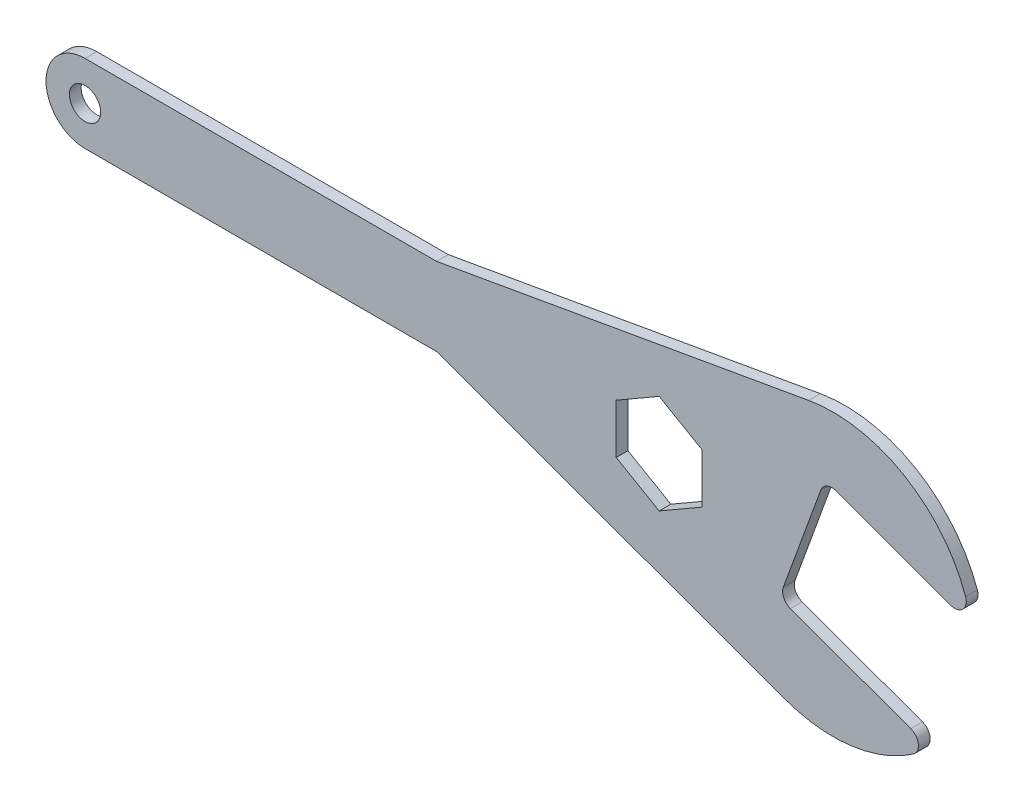
ISO-10303-21;
HEADER;
FILE_DESCRIPTION(('STEP AP214'),'2;1');
FILE_NAME('part.step','',(''),(''),'','','');
FILE_SCHEMA(('AUTOMOTIVE_DESIGN { 1 0 10303 214 1 1 1 1 }'));
ENDSEC;
DATA;
#1=APPLICATION_CONTEXT('core data for automotive mechanical design processes');
#2=APPLICATION_PROTOCOL_DEFINITION('international standard','automotive_design',2000,#1);
#3=PRODUCT_CONTEXT('',#1,'mechanical');
#4=PRODUCT('Part','Part','',(#3));
#5=PRODUCT_RELATED_PRODUCT_CATEGORY('part','',(#4));
#6=PRODUCT_DEFINITION_FORMATION('','',#4);
#7=PRODUCT_DEFINITION_CONTEXT('part definition',#1,'design');
#8=PRODUCT_DEFINITION('design','',#6,#7);
#9=PRODUCT_DEFINITION_SHAPE('','',#8);
#10=(LENGTH_UNIT() NAMED_UNIT(*) SI_UNIT(.MILLI.,.METRE.));
#11=(NAMED_UNIT(*) PLANE_ANGLE_UNIT() SI_UNIT($,.RADIAN.));
#12=(NAMED_UNIT(*) SI_UNIT($,.STERADIAN.) SOLID_ANGLE_UNIT());
#13=UNCERTAINTY_MEASURE_WITH_UNIT(LENGTH_MEASURE(1.E-05),#10,'distance_accuracy_value','');
#14=(GEOMETRIC_REPRESENTATION_CONTEXT(3) GLOBAL_UNCERTAINTY_ASSIGNED_CONTEXT((#13)) GLOBAL_UNIT_ASSIGNED_CONTEXT((#10,
#11,#12)) REPRESENTATION_CONTEXT('',''));
#15=CARTESIAN_POINT('',(0.,0.,0.));
#16=DIRECTION('',(0.,0.,1.));
#17=DIRECTION('',(1.,0.,0.));
#18=AXIS2_PLACEMENT_3D('',#15,#16,#17);
#19=CARTESIAN_POINT('',(0.,0.,3.));
#20=DIRECTION('',(0.,0.,-1.));
#21=DIRECTION('',(-1.,0.,0.));
#22=AXIS2_PLACEMENT_3D('',#19,#20,#21);
#23=CYLINDRICAL_SURFACE('',#22,10.);
#24=CARTESIAN_POINT('',(0.,0.,0.));
#25=DIRECTION('',(0.,0.,1.));
#26=DIRECTION('',(1.,0.,0.));
#27=AXIS2_PLACEMENT_3D('',#24,#25,#26);
#28=CIRCLE('',#27,10.);
#29=CARTESIAN_POINT('',(0.,10.,0.));
#30=VERTEX_POINT('',#29);
#31=CARTESIAN_POINT('',(0.,-10.,0.));
#32=VERTEX_POINT('',#31);
#33=EDGE_CURVE('E258',#30,#32,#28,.T.);
#34=ORIENTED_EDGE('',*,*,#33,.T.);
#35=DIRECTION('',(0.,0.,-1.));
#36=VECTOR('',#35,1.);
#37=CARTESIAN_POINT('',(0.,-10.,3.));
#38=LINE('',#37,#36);
#39=CARTESIAN_POINT('',(0.,-10.,3.));
#40=VERTEX_POINT('',#39);
#41=EDGE_CURVE('E295',#40,#32,#38,.T.);
#42=ORIENTED_EDGE('',*,*,#41,.F.);
#43=CARTESIAN_POINT('',(0.,0.,3.));
#44=DIRECTION('',(0.,0.,1.));
#45=DIRECTION('',(1.,0.,0.));
#46=AXIS2_PLACEMENT_3D('',#43,#44,#45);
#47=CIRCLE('',#46,10.);
#48=CARTESIAN_POINT('',(0.,10.,3.));
#49=VERTEX_POINT('',#48);
#50=EDGE_CURVE('E233',#49,#40,#47,.T.);
#51=ORIENTED_EDGE('',*,*,#50,.F.);
#52=DIRECTION('',(0.,0.,-1.));
#53=VECTOR('',#52,1.);
#54=CARTESIAN_POINT('',(0.,10.,3.));
#55=LINE('',#54,#53);
#56=EDGE_CURVE('E257',#49,#30,#55,.T.);
#57=ORIENTED_EDGE('',*,*,#56,.T.);
#58=EDGE_LOOP('',(#34,#42,#51,#57));
#59=FACE_BOUND('',#58,.T.);
#60=ADVANCED_FACE('F35',(#59),#23,.T.);
#61=CARTESIAN_POINT('',(0.,-10.,3.));
#62=DIRECTION('',(0.,1.,0.));
#63=DIRECTION('',(-1.,0.,0.));
#64=AXIS2_PLACEMENT_3D('',#61,#62,#63);
#65=PLANE('',#64);
#66=DIRECTION('',(1.,0.,0.));
#67=VECTOR('',#66,1.);
#68=CARTESIAN_POINT('',(0.,-10.,0.));
#69=LINE('',#68,#67);
#70=CARTESIAN_POINT('',(89.9804958595262,-10.,0.));
#71=VERTEX_POINT('',#70);
#72=EDGE_CURVE('E261',#32,#71,#69,.T.);
#73=ORIENTED_EDGE('',*,*,#72,.T.);
#74=DIRECTION('',(0.,0.,-1.));
#75=VECTOR('',#74,1.);
#76=CARTESIAN_POINT('',(89.9804958595262,-10.,3.));
#77=LINE('',#76,#75);
#78=CARTESIAN_POINT('',(89.9804958595262,-10.,3.));
#79=VERTEX_POINT('',#78);
#80=EDGE_CURVE('E292',#79,#71,#77,.T.);
#81=ORIENTED_EDGE('',*,*,#80,.F.);
#82=DIRECTION('',(1.,0.,0.));
#83=VECTOR('',#82,1.);
#84=CARTESIAN_POINT('',(0.,-10.,3.));
#85=LINE('',#84,#83);
#86=EDGE_CURVE('E236',#40,#79,#85,.T.);
#87=ORIENTED_EDGE('',*,*,#86,.F.);
#88=ORIENTED_EDGE('',*,*,#41,.T.);
#89=EDGE_LOOP('',(#73,#81,#87,#88));
#90=FACE_BOUND('',#89,.T.);
#91=ADVANCED_FACE('F363',(#90),#65,.F.);
#92=CARTESIAN_POINT('',(89.9804958595262,-10.,3.));
#93=DIRECTION('',(0.34202014332567,0.939692620785908,0.));
#94=DIRECTION('',(-0.939692620785908,0.34202014332567,0.));
#95=AXIS2_PLACEMENT_3D('',#92,#93,#94);
#96=PLANE('',#95);
#97=DIRECTION('',(0.939692620785908,-0.34202014332567,0.));
#98=VECTOR('',#97,1.);
#99=CARTESIAN_POINT('',(89.9804958595262,-10.,0.));
#100=LINE('',#99,#98);
#101=CARTESIAN_POINT('',(179.22149968912,-42.4810690700083,0.));
#102=VERTEX_POINT('',#101);
#103=EDGE_CURVE('E264',#71,#102,#100,.T.);
#104=ORIENTED_EDGE('',*,*,#103,.T.);
#105=DIRECTION('',(0.,0.,-1.));
#106=VECTOR('',#105,1.);
#107=CARTESIAN_POINT('',(179.22149968912,-42.4810690700083,3.));
#108=LINE('',#107,#106);
#109=CARTESIAN_POINT('',(179.22149968912,-42.4810690700083,3.));
#110=VERTEX_POINT('',#109);
#111=EDGE_CURVE('E289',#110,#102,#108,.T.);
#112=ORIENTED_EDGE('',*,*,#111,.F.);
#113=DIRECTION('',(0.939692620785908,-0.34202014332567,0.));
#114=VECTOR('',#113,1.);
#115=CARTESIAN_POINT('',(89.9804958595262,-10.,3.));
#116=LINE('',#115,#114);
#117=EDGE_CURVE('E239',#79,#110,#116,.T.);
#118=ORIENTED_EDGE('',*,*,#117,.F.);
#119=ORIENTED_EDGE('',*,*,#80,.T.);
#120=EDGE_LOOP('',(#104,#112,#118,#119));
#121=FACE_BOUND('',#120,.T.);
#122=ADVANCED_FACE('F370',(#121),#96,.F.);
#123=CARTESIAN_POINT('',(191.534224848844,-8.65213472171563,3.));
#124=DIRECTION('',(0.,0.,-1.));
#125=DIRECTION('',(-1.,0.,0.));
#126=AXIS2_PLACEMENT_3D('',#123,#124,#125);
#127=CYLINDRICAL_SURFACE('',#126,36.);
#128=CARTESIAN_POINT('',(191.534224848844,-8.65213472171563,0.));
#129=DIRECTION('',(0.,0.,1.));
#130=DIRECTION('',(1.,0.,0.));
#131=AXIS2_PLACEMENT_3D('',#128,#129,#130);
#132=CIRCLE('',#131,36.);
#133=CARTESIAN_POINT('',(212.104308868192,-38.1965359415231,0.));
#134=VERTEX_POINT('',#133);
#135=EDGE_CURVE('E266',#102,#134,#132,.T.);
#136=ORIENTED_EDGE('',*,*,#135,.T.);
#137=DIRECTION('',(0.,0.,-1.));
#138=VECTOR('',#137,1.);
#139=CARTESIAN_POINT('',(212.104308868192,-38.1965359415231,3.));
#140=LINE('',#139,#138);
#141=CARTESIAN_POINT('',(212.104308868192,-38.1965359415231,3.));
#142=VERTEX_POINT('',#141);
#143=EDGE_CURVE('E303',#134,#142,#140,.F.);
#144=ORIENTED_EDGE('',*,*,#143,.T.);
#145=CARTESIAN_POINT('',(191.534224848844,-8.65213472171563,3.));
#146=DIRECTION('',(0.,0.,1.));
#147=DIRECTION('',(1.,0.,0.));
#148=AXIS2_PLACEMENT_3D('',#145,#146,#147);
#149=CIRCLE('',#148,36.);
#150=EDGE_CURVE('E241',#110,#142,#149,.T.);
#151=ORIENTED_EDGE('',*,*,#150,.F.);
#152=ORIENTED_EDGE('',*,*,#111,.T.);
#153=EDGE_LOOP('',(#136,#144,#151,#152));
#154=FACE_BOUND('',#153,.T.);
#155=ADVANCED_FACE('F374',(#154),#127,.T.);
#156=CARTESIAN_POINT('',(177.770914252774,-20.6695436994003,3.));
#157=DIRECTION('',(-0.342020143325669,-0.939692620785908,0.));
#158=DIRECTION('',(0.939692620785908,-0.342020143325669,0.));
#159=AXIS2_PLACEMENT_3D('',#156,#157,#158);
#160=PLANE('',#159);
#161=DIRECTION('',(-0.939692620785908,0.342020143325669,0.));
#162=VECTOR('',#161,1.);
#163=CARTESIAN_POINT('',(177.770914252774,-20.6695436994003,0.));
#164=LINE('',#163,#162);
#165=CARTESIAN_POINT('',(211.41619562989,-32.9154246441814,0.));
#166=VERTEX_POINT('',#165);
#167=CARTESIAN_POINT('',(180.589992115132,-21.6956041293773,0.));
#168=VERTEX_POINT('',#167);
#169=EDGE_CURVE('E269',#166,#168,#164,.T.);
#170=ORIENTED_EDGE('',*,*,#169,.T.);
#171=DIRECTION('',(0.,0.,-1.));
#172=VECTOR('',#171,1.);
#173=CARTESIAN_POINT('',(180.589992115132,-21.6956041293773,3.));
#174=LINE('',#173,#172);
#175=CARTESIAN_POINT('',(180.589992115132,-21.6956041293773,3.));
#176=VERTEX_POINT('',#175);
#177=EDGE_CURVE('E321',#168,#176,#174,.F.);
#178=ORIENTED_EDGE('',*,*,#177,.T.);
#179=DIRECTION('',(-0.939692620785908,0.342020143325669,0.));
#180=VECTOR('',#179,1.);
#181=CARTESIAN_POINT('',(177.770914252774,-20.6695436994003,3.));
#182=LINE('',#181,#180);
#183=CARTESIAN_POINT('',(211.41619562989,-32.9154246441814,3.));
#184=VERTEX_POINT('',#183);
#185=EDGE_CURVE('E244',#184,#176,#182,.T.);
#186=ORIENTED_EDGE('',*,*,#185,.F.);
#187=DIRECTION('',(0.,0.,-1.));
#188=VECTOR('',#187,1.);
#189=CARTESIAN_POINT('',(211.41619562989,-32.9154246441814,3.));
#190=LINE('',#189,#188);
#191=EDGE_CURVE('E298',#184,#166,#190,.T.);
#192=ORIENTED_EDGE('',*,*,#191,.T.);
#193=EDGE_LOOP('',(#170,#178,#186,#192));
#194=FACE_BOUND('',#193,.T.);
#195=ADVANCED_FACE('F382',(#194),#160,.F.);
#196=CARTESIAN_POINT('',(189.399599125847,11.2800054073206,3.));
#197=DIRECTION('',(-0.939692620785908,0.342020143325669,0.));
#198=DIRECTION('',(-0.342020143325669,-0.939692620785908,0.));
#199=AXIS2_PLACEMENT_3D('',#196,#197,#198);
#200=PLANE('',#199);
#201=DIRECTION('',(0.342020143325669,0.939692620785908,0.));
#202=VECTOR('',#201,1.);
#203=CARTESIAN_POINT('',(189.399599125847,11.2800054073206,0.));
#204=LINE('',#203,#202);
#205=CARTESIAN_POINT('',(178.796974682751,-17.8504658370425,0.));
#206=VERTEX_POINT('',#205);
#207=CARTESIAN_POINT('',(188.37353869587,8.4609275449629,0.));
#208=VERTEX_POINT('',#207);
#209=EDGE_CURVE('E272',#206,#208,#204,.T.);
#210=ORIENTED_EDGE('',*,*,#209,.T.);
#211=DIRECTION('',(0.,0.,-1.));
#212=VECTOR('',#211,1.);
#213=CARTESIAN_POINT('',(188.37353869587,8.46092754496291,3.));
#214=LINE('',#213,#212);
#215=CARTESIAN_POINT('',(188.37353869587,8.4609275449629,3.));
#216=VERTEX_POINT('',#215);
#217=EDGE_CURVE('E56',#208,#216,#214,.F.);
#218=ORIENTED_EDGE('',*,*,#217,.T.);
#219=DIRECTION('',(0.342020143325669,0.939692620785908,0.));
#220=VECTOR('',#219,1.);
#221=CARTESIAN_POINT('',(189.399599125847,11.2800054073206,3.));
#222=LINE('',#221,#220);
#223=CARTESIAN_POINT('',(178.796974682751,-17.8504658370425,3.));
#224=VERTEX_POINT('',#223);
#225=EDGE_CURVE('E247',#224,#216,#222,.T.);
#226=ORIENTED_EDGE('',*,*,#225,.F.);
#227=DIRECTION('',(0.,0.,-1.));
#228=VECTOR('',#227,1.);
#229=CARTESIAN_POINT('',(178.796974682751,-17.8504658370425,0.));
#230=LINE('',#229,#228);
#231=EDGE_CURVE('E318',#224,#206,#230,.T.);
#232=ORIENTED_EDGE('',*,*,#231,.T.);
#233=EDGE_LOOP('',(#210,#218,#226,#232));
#234=FACE_BOUND('',#233,.T.);
#235=ADVANCED_FACE('F388',(#234),#200,.F.);
#236=CARTESIAN_POINT('',(226.987303957283,-2.40080032570615,3.));
#237=DIRECTION('',(0.34202014332567,0.939692620785908,0.));
#238=DIRECTION('',(-0.939692620785908,0.34202014332567,0.));
#239=AXIS2_PLACEMENT_3D('',#236,#237,#238);
#240=PLANE('',#239);
#241=DIRECTION('',(0.939692620785908,-0.34202014332567,0.));
#242=VECTOR('',#241,1.);
#243=CARTESIAN_POINT('',(226.987303957283,-2.40080032570615,3.));
#244=LINE('',#243,#242);
#245=CARTESIAN_POINT('',(192.218676988205,10.2539449773436,3.));
#246=VERTEX_POINT('',#245);
#247=CARTESIAN_POINT('',(221.611256306698,-0.444079002896385,3.));
#248=VERTEX_POINT('',#247);
#249=EDGE_CURVE('E249',#246,#248,#244,.T.);
#250=ORIENTED_EDGE('',*,*,#249,.F.);
#251=DIRECTION('',(0.,0.,-1.));
#252=VECTOR('',#251,1.);
#253=CARTESIAN_POINT('',(192.218676988205,10.2539449773436,0.));
#254=LINE('',#253,#252);
#255=CARTESIAN_POINT('',(192.218676988205,10.2539449773436,0.));
#256=VERTEX_POINT('',#255);
#257=EDGE_CURVE('E327',#246,#256,#254,.T.);
#258=ORIENTED_EDGE('',*,*,#257,.T.);
#259=DIRECTION('',(0.939692620785908,-0.34202014332567,0.));
#260=VECTOR('',#259,1.);
#261=CARTESIAN_POINT('',(226.987303957283,-2.40080032570615,0.));
#262=LINE('',#261,#260);
#263=CARTESIAN_POINT('',(221.611256306698,-0.444079002896385,0.));
#264=VERTEX_POINT('',#263);
#265=EDGE_CURVE('E274',#256,#264,#262,.T.);
#266=ORIENTED_EDGE('',*,*,#265,.T.);
#267=DIRECTION('',(0.,0.,-1.));
#268=VECTOR('',#267,1.);
#269=CARTESIAN_POINT('',(221.611256306698,-0.444079002896386,3.));
#270=LINE('',#269,#268);
#271=EDGE_CURVE('E313',#264,#248,#270,.F.);
#272=ORIENTED_EDGE('',*,*,#271,.T.);
#273=EDGE_LOOP('',(#250,#258,#266,#272));
#274=FACE_BOUND('',#273,.T.);
#275=ADVANCED_FACE('F333',(#274),#240,.F.);
#276=CARTESIAN_POINT('',(191.534224848844,-8.65213472171563,3.));
#277=DIRECTION('',(0.,0.,-1.));
#278=DIRECTION('',(-1.,0.,0.));
#279=AXIS2_PLACEMENT_3D('',#276,#277,#278);
#280=CYLINDRICAL_SURFACE('',#279,36.);
#281=CARTESIAN_POINT('',(191.534224848844,-8.65213472171563,3.));
#282=DIRECTION('',(0.,0.,1.));
#283=DIRECTION('',(-1.,0.,0.));
#284=AXIS2_PLACEMENT_3D('',#281,#282,#283);
#285=CIRCLE('',#284,36.);
#286=CARTESIAN_POINT('',(225.46487054466,3.37746554865924,3.));
#287=VERTEX_POINT('',#286);
#288=CARTESIAN_POINT('',(185.282890452834,26.8009443867239,3.));
#289=VERTEX_POINT('',#288);
#290=EDGE_CURVE('E251',#287,#289,#285,.T.);
#291=ORIENTED_EDGE('',*,*,#290,.F.);
#292=DIRECTION('',(0.,0.,-1.));
#293=VECTOR('',#292,1.);
#294=CARTESIAN_POINT('',(225.46487054466,3.37746554865924,3.));
#295=LINE('',#294,#293);
#296=CARTESIAN_POINT('',(225.46487054466,3.37746554865924,0.));
#297=VERTEX_POINT('',#296);
#298=EDGE_CURVE('E307',#287,#297,#295,.T.);
#299=ORIENTED_EDGE('',*,*,#298,.T.);
#300=CARTESIAN_POINT('',(191.534224848844,-8.65213472171563,0.));
#301=DIRECTION('',(0.,0.,1.));
#302=DIRECTION('',(-1.,0.,0.));
#303=AXIS2_PLACEMENT_3D('',#300,#301,#302);
#304=CIRCLE('',#303,36.);
#305=CARTESIAN_POINT('',(185.282890452834,26.8009443867239,0.));
#306=VERTEX_POINT('',#305);
#307=EDGE_CURVE('E276',#297,#306,#304,.T.);
#308=ORIENTED_EDGE('',*,*,#307,.T.);
#309=DIRECTION('',(0.,0.,-1.));
#310=VECTOR('',#309,1.);
#311=CARTESIAN_POINT('',(185.282890452834,26.8009443867239,3.));
#312=LINE('',#311,#310);
#313=EDGE_CURVE('E286',#289,#306,#312,.T.);
#314=ORIENTED_EDGE('',*,*,#313,.F.);
#315=EDGE_LOOP('',(#291,#299,#308,#314));
#316=FACE_BOUND('',#315,.T.);
#317=ADVANCED_FACE('F348',(#316),#280,.T.);
#318=CARTESIAN_POINT('',(90.,10.,3.));
#319=DIRECTION('',(0.173648177666932,-0.984807753012208,0.));
#320=DIRECTION('',(0.984807753012208,0.173648177666932,0.));
#321=AXIS2_PLACEMENT_3D('',#318,#319,#320);
#322=PLANE('',#321);
#323=DIRECTION('',(-0.984807753012208,-0.173648177666932,0.));
#324=VECTOR('',#323,1.);
#325=CARTESIAN_POINT('',(90.,10.,0.));
#326=LINE('',#325,#324);
#327=CARTESIAN_POINT('',(90.,10.,0.));
#328=VERTEX_POINT('',#327);
#329=EDGE_CURVE('E278',#306,#328,#326,.T.);
#330=ORIENTED_EDGE('',*,*,#329,.T.);
#331=DIRECTION('',(0.,0.,-1.));
#332=VECTOR('',#331,1.);
#333=CARTESIAN_POINT('',(90.,10.,3.));
#334=LINE('',#333,#332);
#335=CARTESIAN_POINT('',(90.,10.,3.));
#336=VERTEX_POINT('',#335);
#337=EDGE_CURVE('E283',#336,#328,#334,.T.);
#338=ORIENTED_EDGE('',*,*,#337,.F.);
#339=DIRECTION('',(-0.984807753012208,-0.173648177666932,0.));
#340=VECTOR('',#339,1.);
#341=CARTESIAN_POINT('',(90.,10.,3.));
#342=LINE('',#341,#340);
#343=EDGE_CURVE('E253',#289,#336,#342,.T.);
#344=ORIENTED_EDGE('',*,*,#343,.F.);
#345=ORIENTED_EDGE('',*,*,#313,.T.);
#346=EDGE_LOOP('',(#330,#338,#344,#345));
#347=FACE_BOUND('',#346,.T.);
#348=ADVANCED_FACE('F352',(#347),#322,.F.);
#349=CARTESIAN_POINT('',(0.,10.,3.));
#350=DIRECTION('',(0.,-1.,0.));
#351=DIRECTION('',(1.,0.,0.));
#352=AXIS2_PLACEMENT_3D('',#349,#350,#351);
#353=PLANE('',#352);
#354=DIRECTION('',(-1.,0.,0.));
#355=VECTOR('',#354,1.);
#356=CARTESIAN_POINT('',(0.,10.,0.));
#357=LINE('',#356,#355);
#358=EDGE_CURVE('E237',#328,#30,#357,.T.);
#359=ORIENTED_EDGE('',*,*,#358,.T.);
#360=ORIENTED_EDGE('',*,*,#56,.F.);
#361=DIRECTION('',(-1.,0.,0.));
#362=VECTOR('',#361,1.);
#363=CARTESIAN_POINT('',(0.,10.,3.));
#364=LINE('',#363,#362);
#365=EDGE_CURVE('E255',#336,#49,#364,.T.);
#366=ORIENTED_EDGE('',*,*,#365,.F.);
#367=ORIENTED_EDGE('',*,*,#337,.T.);
#368=EDGE_LOOP('',(#359,#360,#366,#367));
#369=FACE_BOUND('',#368,.T.);
#370=ADVANCED_FACE('F358',(#369),#353,.F.);
#371=CARTESIAN_POINT('',(0.,0.,3.));
#372=DIRECTION('',(0.,0.,1.));
#373=DIRECTION('',(1.,0.,0.));
#374=AXIS2_PLACEMENT_3D('',#371,#372,#373);
#375=PLANE('',#374);
#376=CARTESIAN_POINT('',(0.,0.,3.));
#377=DIRECTION('',(0.,0.,1.));
#378=DIRECTION('',(1.,0.,0.));
#379=AXIS2_PLACEMENT_3D('',#376,#377,#378);
#380=CIRCLE('',#379,4.);
#381=CARTESIAN_POINT('',(4.,0.,3.));
#382=VERTEX_POINT('',#381);
#383=EDGE_CURVE('E203',#382,#382,#380,.T.);
#384=ORIENTED_EDGE('',*,*,#383,.F.);
#385=EDGE_LOOP('',(#384));
#386=FACE_BOUND('',#385,.T.);
#387=DIRECTION('',(0.866025403784439,-0.5,0.));
#388=VECTOR('',#387,1.);
#389=CARTESIAN_POINT('',(136.,-10.4998109289391,3.));
#390=LINE('',#389,#388);
#391=CARTESIAN_POINT('',(136.,-10.4998109289391,3.));
#392=VERTEX_POINT('',#391);
#393=CARTESIAN_POINT('',(147.,-16.8506638900249,3.));
#394=VERTEX_POINT('',#393);
#395=EDGE_CURVE('E179',#392,#394,#390,.T.);
#396=ORIENTED_EDGE('',*,*,#395,.F.);
#397=DIRECTION('',(0.,-1.,0.));
#398=VECTOR('',#397,1.);
#399=CARTESIAN_POINT('',(136.,2.20189499323271,3.));
#400=LINE('',#399,#398);
#401=CARTESIAN_POINT('',(136.,2.20189499323271,3.));
#402=VERTEX_POINT('',#401);
#403=EDGE_CURVE('E197',#402,#392,#400,.T.);
#404=ORIENTED_EDGE('',*,*,#403,.F.);
#405=DIRECTION('',(-0.866025403784439,-0.5,0.));
#406=VECTOR('',#405,1.);
#407=CARTESIAN_POINT('',(147.,8.55274795431858,3.));
#408=LINE('',#407,#406);
#409=CARTESIAN_POINT('',(147.,8.55274795431858,3.));
#410=VERTEX_POINT('',#409);
#411=EDGE_CURVE('E200',#410,#402,#408,.T.);
#412=ORIENTED_EDGE('',*,*,#411,.F.);
#413=DIRECTION('',(-0.866025403784439,0.5,0.));
#414=VECTOR('',#413,1.);
#415=CARTESIAN_POINT('',(158.,2.20189499323271,3.));
#416=LINE('',#415,#414);
#417=CARTESIAN_POINT('',(158.,2.20189499323271,3.));
#418=VERTEX_POINT('',#417);
#419=EDGE_CURVE('E219',#418,#410,#416,.T.);
#420=ORIENTED_EDGE('',*,*,#419,.F.);
#421=DIRECTION('',(0.,1.,0.));
#422=VECTOR('',#421,1.);
#423=CARTESIAN_POINT('',(158.,-10.499810928939,3.));
#424=LINE('',#423,#422);
#425=CARTESIAN_POINT('',(158.,-10.499810928939,3.));
#426=VERTEX_POINT('',#425);
#427=EDGE_CURVE('E216',#426,#418,#424,.T.);
#428=ORIENTED_EDGE('',*,*,#427,.F.);
#429=DIRECTION('',(0.866025403784438,0.500000000000001,0.));
#430=VECTOR('',#429,1.);
#431=CARTESIAN_POINT('',(147.,-16.8506638900249,3.));
#432=LINE('',#431,#430);
#433=EDGE_CURVE('E214',#394,#426,#432,.T.);
#434=ORIENTED_EDGE('',*,*,#433,.F.);
#435=EDGE_LOOP('',(#396,#404,#412,#420,#428,#434));
#436=FACE_BOUND('',#435,.T.);
#437=ORIENTED_EDGE('',*,*,#225,.T.);
#438=CARTESIAN_POINT('',(191.192616558228,7.4348671149859,3.));
#439=DIRECTION('',(0.,0.,1.));
#440=DIRECTION('',(1.,0.,0.));
#441=AXIS2_PLACEMENT_3D('',#438,#439,#440);
#442=CIRCLE('',#441,3.);
#443=EDGE_CURVE('E11',#216,#246,#442,.F.);
#444=ORIENTED_EDGE('',*,*,#443,.T.);
#445=ORIENTED_EDGE('',*,*,#249,.T.);
#446=CARTESIAN_POINT('',(222.637316736675,2.37499885946133,3.));
#447=DIRECTION('',(0.,0.,1.));
#448=DIRECTION('',(1.,0.,0.));
#449=AXIS2_PLACEMENT_3D('',#446,#447,#448);
#450=CIRCLE('',#449,3.);
#451=EDGE_CURVE('E316',#248,#287,#450,.T.);
#452=ORIENTED_EDGE('',*,*,#451,.T.);
#453=ORIENTED_EDGE('',*,*,#290,.T.);
#454=ORIENTED_EDGE('',*,*,#343,.T.);
#455=ORIENTED_EDGE('',*,*,#365,.T.);
#456=ORIENTED_EDGE('',*,*,#50,.T.);
#457=ORIENTED_EDGE('',*,*,#86,.T.);
#458=ORIENTED_EDGE('',*,*,#117,.T.);
#459=ORIENTED_EDGE('',*,*,#150,.T.);
#460=CARTESIAN_POINT('',(210.390135199913,-35.7345025065391,3.));
#461=DIRECTION('',(0.,0.,1.));
#462=DIRECTION('',(1.,0.,0.));
#463=AXIS2_PLACEMENT_3D('',#460,#461,#462);
#464=CIRCLE('',#463,3.);
#465=EDGE_CURVE('E305',#142,#184,#464,.T.);
#466=ORIENTED_EDGE('',*,*,#465,.T.);
#467=ORIENTED_EDGE('',*,*,#185,.T.);
#468=CARTESIAN_POINT('',(181.616052545109,-18.8765262670195,3.));
#469=DIRECTION('',(0.,0.,1.));
#470=DIRECTION('',(1.,0.,0.));
#471=AXIS2_PLACEMENT_3D('',#468,#469,#470);
#472=CIRCLE('',#471,3.);
#473=EDGE_CURVE('E325',#176,#224,#472,.F.);
#474=ORIENTED_EDGE('',*,*,#473,.T.);
#475=EDGE_LOOP('',(#437,#444,#445,#452,#453,#454,#455,#456,#457,#458,#459,#466,#467,#474));
#476=FACE_BOUND('',#475,.T.);
#477=ADVANCED_FACE('F345',(#386,#436,#476),#375,.T.);
#478=CARTESIAN_POINT('',(0.,0.,0.));
#479=DIRECTION('',(0.,0.,1.));
#480=DIRECTION('',(1.,0.,0.));
#481=AXIS2_PLACEMENT_3D('',#478,#479,#480);
#482=PLANE('',#481);
#483=CARTESIAN_POINT('',(0.,0.,0.));
#484=DIRECTION('',(0.,0.,1.));
#485=DIRECTION('',(1.,0.,0.));
#486=AXIS2_PLACEMENT_3D('',#483,#484,#485);
#487=CIRCLE('',#486,4.);
#488=CARTESIAN_POINT('',(4.,0.,0.));
#489=VERTEX_POINT('',#488);
#490=EDGE_CURVE('E262',#489,#489,#487,.T.);
#491=ORIENTED_EDGE('',*,*,#490,.T.);
#492=EDGE_LOOP('',(#491));
#493=FACE_BOUND('',#492,.T.);
#494=DIRECTION('',(0.,-1.,0.));
#495=VECTOR('',#494,1.);
#496=CARTESIAN_POINT('',(136.,2.20189499323271,0.));
#497=LINE('',#496,#495);
#498=CARTESIAN_POINT('',(136.,2.20189499323271,0.));
#499=VERTEX_POINT('',#498);
#500=CARTESIAN_POINT('',(136.,-10.4998109289391,0.));
#501=VERTEX_POINT('',#500);
#502=EDGE_CURVE('E184',#499,#501,#497,.T.);
#503=ORIENTED_EDGE('',*,*,#502,.T.);
#504=DIRECTION('',(0.866025403784439,-0.5,0.));
#505=VECTOR('',#504,1.);
#506=CARTESIAN_POINT('',(136.,-10.4998109289391,0.));
#507=LINE('',#506,#505);
#508=CARTESIAN_POINT('',(147.,-16.8506638900249,0.));
#509=VERTEX_POINT('',#508);
#510=EDGE_CURVE('E176',#501,#509,#507,.T.);
#511=ORIENTED_EDGE('',*,*,#510,.T.);
#512=DIRECTION('',(0.866025403784438,0.500000000000001,0.));
#513=VECTOR('',#512,1.);
#514=CARTESIAN_POINT('',(147.,-16.8506638900249,0.));
#515=LINE('',#514,#513);
#516=CARTESIAN_POINT('',(158.,-10.499810928939,0.));
#517=VERTEX_POINT('',#516);
#518=EDGE_CURVE('E188',#509,#517,#515,.T.);
#519=ORIENTED_EDGE('',*,*,#518,.T.);
#520=DIRECTION('',(0.,1.,0.));
#521=VECTOR('',#520,1.);
#522=CARTESIAN_POINT('',(158.,-10.499810928939,0.));
#523=LINE('',#522,#521);
#524=CARTESIAN_POINT('',(158.,2.20189499323271,0.));
#525=VERTEX_POINT('',#524);
#526=EDGE_CURVE('E192',#517,#525,#523,.T.);
#527=ORIENTED_EDGE('',*,*,#526,.T.);
#528=DIRECTION('',(-0.866025403784439,0.5,0.));
#529=VECTOR('',#528,1.);
#530=CARTESIAN_POINT('',(158.,2.20189499323271,0.));
#531=LINE('',#530,#529);
#532=CARTESIAN_POINT('',(147.,8.55274795431858,0.));
#533=VERTEX_POINT('',#532);
#534=EDGE_CURVE('E207',#525,#533,#531,.T.);
#535=ORIENTED_EDGE('',*,*,#534,.T.);
#536=DIRECTION('',(-0.866025403784439,-0.5,0.));
#537=VECTOR('',#536,1.);
#538=CARTESIAN_POINT('',(147.,8.55274795431858,0.));
#539=LINE('',#538,#537);
#540=EDGE_CURVE('E210',#533,#499,#539,.T.);
#541=ORIENTED_EDGE('',*,*,#540,.T.);
#542=EDGE_LOOP('',(#503,#511,#519,#527,#535,#541));
#543=FACE_BOUND('',#542,.T.);
#544=ORIENTED_EDGE('',*,*,#307,.F.);
#545=CARTESIAN_POINT('',(222.637316736675,2.37499885946133,0.));
#546=DIRECTION('',(0.,0.,1.));
#547=DIRECTION('',(1.,0.,0.));
#548=AXIS2_PLACEMENT_3D('',#545,#546,#547);
#549=CIRCLE('',#548,3.);
#550=EDGE_CURVE('E310',#297,#264,#549,.F.);
#551=ORIENTED_EDGE('',*,*,#550,.T.);
#552=ORIENTED_EDGE('',*,*,#265,.F.);
#553=CARTESIAN_POINT('',(191.192616558228,7.4348671149859,0.));
#554=DIRECTION('',(0.,0.,1.));
#555=DIRECTION('',(1.,0.,0.));
#556=AXIS2_PLACEMENT_3D('',#553,#554,#555);
#557=CIRCLE('',#556,3.);
#558=EDGE_CURVE('E43',#256,#208,#557,.T.);
#559=ORIENTED_EDGE('',*,*,#558,.T.);
#560=ORIENTED_EDGE('',*,*,#209,.F.);
#561=CARTESIAN_POINT('',(181.616052545109,-18.8765262670195,0.));
#562=DIRECTION('',(0.,0.,1.));
#563=DIRECTION('',(1.,0.,0.));
#564=AXIS2_PLACEMENT_3D('',#561,#562,#563);
#565=CIRCLE('',#564,3.);
#566=EDGE_CURVE('E323',#206,#168,#565,.T.);
#567=ORIENTED_EDGE('',*,*,#566,.T.);
#568=ORIENTED_EDGE('',*,*,#169,.F.);
#569=CARTESIAN_POINT('',(210.390135199913,-35.7345025065391,0.));
#570=DIRECTION('',(0.,0.,1.));
#571=DIRECTION('',(1.,0.,0.));
#572=AXIS2_PLACEMENT_3D('',#569,#570,#571);
#573=CIRCLE('',#572,3.);
#574=EDGE_CURVE('E301',#166,#134,#573,.F.);
#575=ORIENTED_EDGE('',*,*,#574,.T.);
#576=ORIENTED_EDGE('',*,*,#135,.F.);
#577=ORIENTED_EDGE('',*,*,#103,.F.);
#578=ORIENTED_EDGE('',*,*,#72,.F.);
#579=ORIENTED_EDGE('',*,*,#33,.F.);
#580=ORIENTED_EDGE('',*,*,#358,.F.);
#581=ORIENTED_EDGE('',*,*,#329,.F.);
#582=EDGE_LOOP('',(#544,#551,#552,#559,#560,#567,#568,#575,#576,#577,#578,#579,#580,#581));
#583=FACE_BOUND('',#582,.T.);
#584=ADVANCED_FACE('F194',(#493,#543,#583),#482,.F.);
#585=CARTESIAN_POINT('',(136.,-10.4998109289391,0.));
#586=DIRECTION('',(-0.5,-0.866025403784439,0.));
#587=DIRECTION('',(0.866025403784439,-0.5,0.));
#588=AXIS2_PLACEMENT_3D('',#585,#586,#587);
#589=PLANE('',#588);
#590=ORIENTED_EDGE('',*,*,#395,.T.);
#591=DIRECTION('',(0.,0.,1.));
#592=VECTOR('',#591,1.);
#593=CARTESIAN_POINT('',(147.,-16.8506638900249,0.));
#594=LINE('',#593,#592);
#595=EDGE_CURVE('E172',#509,#394,#594,.T.);
#596=ORIENTED_EDGE('',*,*,#595,.F.);
#597=ORIENTED_EDGE('',*,*,#510,.F.);
#598=DIRECTION('',(0.,0.,1.));
#599=VECTOR('',#598,1.);
#600=CARTESIAN_POINT('',(136.,-10.4998109289391,0.));
#601=LINE('',#600,#599);
#602=EDGE_CURVE('E224',#501,#392,#601,.T.);
#603=ORIENTED_EDGE('',*,*,#602,.T.);
#604=EDGE_LOOP('',(#590,#596,#597,#603));
#605=FACE_BOUND('',#604,.T.);
#606=ADVANCED_FACE('F174',(#605),#589,.F.);
#607=CARTESIAN_POINT('',(136.,2.20189499323271,0.));
#608=DIRECTION('',(-1.,0.,0.));
#609=DIRECTION('',(0.,-1.,0.));
#610=AXIS2_PLACEMENT_3D('',#607,#608,#609);
#611=PLANE('',#610);
#612=ORIENTED_EDGE('',*,*,#403,.T.);
#613=ORIENTED_EDGE('',*,*,#602,.F.);
#614=ORIENTED_EDGE('',*,*,#502,.F.);
#615=DIRECTION('',(0.,0.,1.));
#616=VECTOR('',#615,1.);
#617=CARTESIAN_POINT('',(136.,2.20189499323271,0.));
#618=LINE('',#617,#616);
#619=EDGE_CURVE('E226',#499,#402,#618,.T.);
#620=ORIENTED_EDGE('',*,*,#619,.T.);
#621=EDGE_LOOP('',(#612,#613,#614,#620));
#622=FACE_BOUND('',#621,.T.);
#623=ADVANCED_FACE('F470',(#622),#611,.F.);
#624=CARTESIAN_POINT('',(147.,8.55274795431858,0.));
#625=DIRECTION('',(-0.5,0.866025403784439,0.));
#626=DIRECTION('',(-0.866025403784439,-0.5,0.));
#627=AXIS2_PLACEMENT_3D('',#624,#625,#626);
#628=PLANE('',#627);
#629=ORIENTED_EDGE('',*,*,#411,.T.);
#630=ORIENTED_EDGE('',*,*,#619,.F.);
#631=ORIENTED_EDGE('',*,*,#540,.F.);
#632=DIRECTION('',(0.,0.,1.));
#633=VECTOR('',#632,1.);
#634=CARTESIAN_POINT('',(147.,8.55274795431858,0.));
#635=LINE('',#634,#633);
#636=EDGE_CURVE('E228',#533,#410,#635,.T.);
#637=ORIENTED_EDGE('',*,*,#636,.T.);
#638=EDGE_LOOP('',(#629,#630,#631,#637));
#639=FACE_BOUND('',#638,.T.);
#640=ADVANCED_FACE('F477',(#639),#628,.F.);
#641=CARTESIAN_POINT('',(158.,2.20189499323271,0.));
#642=DIRECTION('',(0.5,0.866025403784439,0.));
#643=DIRECTION('',(-0.866025403784439,0.5,0.));
#644=AXIS2_PLACEMENT_3D('',#641,#642,#643);
#645=PLANE('',#644);
#646=ORIENTED_EDGE('',*,*,#419,.T.);
#647=ORIENTED_EDGE('',*,*,#636,.F.);
#648=ORIENTED_EDGE('',*,*,#534,.F.);
#649=DIRECTION('',(0.,0.,1.));
#650=VECTOR('',#649,1.);
#651=CARTESIAN_POINT('',(158.,2.20189499323271,0.));
#652=LINE('',#651,#650);
#653=EDGE_CURVE('E230',#525,#418,#652,.T.);
#654=ORIENTED_EDGE('',*,*,#653,.T.);
#655=EDGE_LOOP('',(#646,#647,#648,#654));
#656=FACE_BOUND('',#655,.T.);
#657=ADVANCED_FACE('F485',(#656),#645,.F.);
#658=CARTESIAN_POINT('',(158.,-10.499810928939,0.));
#659=DIRECTION('',(1.,0.,0.));
#660=DIRECTION('',(0.,0.,-1.));
#661=AXIS2_PLACEMENT_3D('',#658,#659,#660);
#662=PLANE('',#661);
#663=ORIENTED_EDGE('',*,*,#427,.T.);
#664=ORIENTED_EDGE('',*,*,#653,.F.);
#665=ORIENTED_EDGE('',*,*,#526,.F.);
#666=DIRECTION('',(0.,0.,1.));
#667=VECTOR('',#666,1.);
#668=CARTESIAN_POINT('',(158.,-10.499810928939,0.));
#669=LINE('',#668,#667);
#670=EDGE_CURVE('E183',#517,#426,#669,.T.);
#671=ORIENTED_EDGE('',*,*,#670,.T.);
#672=EDGE_LOOP('',(#663,#664,#665,#671));
#673=FACE_BOUND('',#672,.T.);
#674=ADVANCED_FACE('F493',(#673),#662,.F.);
#675=CARTESIAN_POINT('',(147.,-16.8506638900249,0.));
#676=DIRECTION('',(0.500000000000001,-0.866025403784438,0.));
#677=DIRECTION('',(0.866025403784438,0.500000000000001,0.));
#678=AXIS2_PLACEMENT_3D('',#675,#676,#677);
#679=PLANE('',#678);
#680=ORIENTED_EDGE('',*,*,#433,.T.);
#681=ORIENTED_EDGE('',*,*,#670,.F.);
#682=ORIENTED_EDGE('',*,*,#518,.F.);
#683=ORIENTED_EDGE('',*,*,#595,.T.);
#684=EDGE_LOOP('',(#680,#681,#682,#683));
#685=FACE_BOUND('',#684,.T.);
#686=ADVANCED_FACE('F189',(#685),#679,.F.);
#687=CARTESIAN_POINT('',(0.,0.,0.));
#688=DIRECTION('',(0.,0.,1.));
#689=DIRECTION('',(1.,0.,0.));
#690=AXIS2_PLACEMENT_3D('',#687,#688,#689);
#691=CYLINDRICAL_SURFACE('',#690,4.);
#692=ORIENTED_EDGE('',*,*,#490,.F.);
#693=EDGE_LOOP('',(#692));
#694=FACE_BOUND('',#693,.T.);
#695=ORIENTED_EDGE('',*,*,#383,.T.);
#696=EDGE_LOOP('',(#695));
#697=FACE_BOUND('',#696,.T.);
#698=ADVANCED_FACE('F403',(#694,#697),#691,.F.);
#699=CARTESIAN_POINT('',(210.390135199913,-35.7345025065391,3.));
#700=DIRECTION('',(0.,0.,-1.));
#701=DIRECTION('',(-1.,0.,0.));
#702=AXIS2_PLACEMENT_3D('',#699,#700,#701);
#703=CYLINDRICAL_SURFACE('',#702,3.);
#704=ORIENTED_EDGE('',*,*,#465,.F.);
#705=ORIENTED_EDGE('',*,*,#143,.F.);
#706=ORIENTED_EDGE('',*,*,#574,.F.);
#707=ORIENTED_EDGE('',*,*,#191,.F.);
#708=EDGE_LOOP('',(#704,#705,#706,#707));
#709=FACE_BOUND('',#708,.T.);
#710=ADVANCED_FACE('F377',(#709),#703,.T.);
#711=CARTESIAN_POINT('',(222.637316736675,2.37499885946133,3.));
#712=DIRECTION('',(0.,0.,-1.));
#713=DIRECTION('',(-1.,0.,0.));
#714=AXIS2_PLACEMENT_3D('',#711,#712,#713);
#715=CYLINDRICAL_SURFACE('',#714,3.);
#716=ORIENTED_EDGE('',*,*,#451,.F.);
#717=ORIENTED_EDGE('',*,*,#271,.F.);
#718=ORIENTED_EDGE('',*,*,#550,.F.);
#719=ORIENTED_EDGE('',*,*,#298,.F.);
#720=EDGE_LOOP('',(#716,#717,#718,#719));
#721=FACE_BOUND('',#720,.T.);
#722=ADVANCED_FACE('F342',(#721),#715,.T.);
#723=CARTESIAN_POINT('',(181.616052545109,-18.8765262670195,3.));
#724=DIRECTION('',(0.,0.,1.));
#725=DIRECTION('',(1.,0.,0.));
#726=AXIS2_PLACEMENT_3D('',#723,#724,#725);
#727=CYLINDRICAL_SURFACE('',#726,3.);
#728=ORIENTED_EDGE('',*,*,#473,.F.);
#729=ORIENTED_EDGE('',*,*,#177,.F.);
#730=ORIENTED_EDGE('',*,*,#566,.F.);
#731=ORIENTED_EDGE('',*,*,#231,.F.);
#732=EDGE_LOOP('',(#728,#729,#730,#731));
#733=FACE_BOUND('',#732,.T.);
#734=ADVANCED_FACE('F386',(#733),#727,.F.);
#735=CARTESIAN_POINT('',(191.192616558228,7.4348671149859,3.));
#736=DIRECTION('',(0.,0.,1.));
#737=DIRECTION('',(1.,0.,0.));
#738=AXIS2_PLACEMENT_3D('',#735,#736,#737);
#739=CYLINDRICAL_SURFACE('',#738,3.);
#740=ORIENTED_EDGE('',*,*,#443,.F.);
#741=ORIENTED_EDGE('',*,*,#217,.F.);
#742=ORIENTED_EDGE('',*,*,#558,.F.);
#743=ORIENTED_EDGE('',*,*,#257,.F.);
#744=EDGE_LOOP('',(#740,#741,#742,#743));
#745=FACE_BOUND('',#744,.T.);
#746=ADVANCED_FACE('F37',(#745),#739,.F.);
#747=CLOSED_SHELL('',(#60,#91,#122,#155,#195,#235,#275,#317,#348,#370,#477,#584,#606,#623,#640,
#657,#674,#686,#698,#710,#722,#734,#746));
#748=MANIFOLD_SOLID_BREP('B2',#747);
#749=ADVANCED_BREP_SHAPE_REPRESENTATION('',(#18,#748),#14);
#750=SHAPE_DEFINITION_REPRESENTATION(#9,#749);
ENDSEC;
END-ISO-10303-21;
